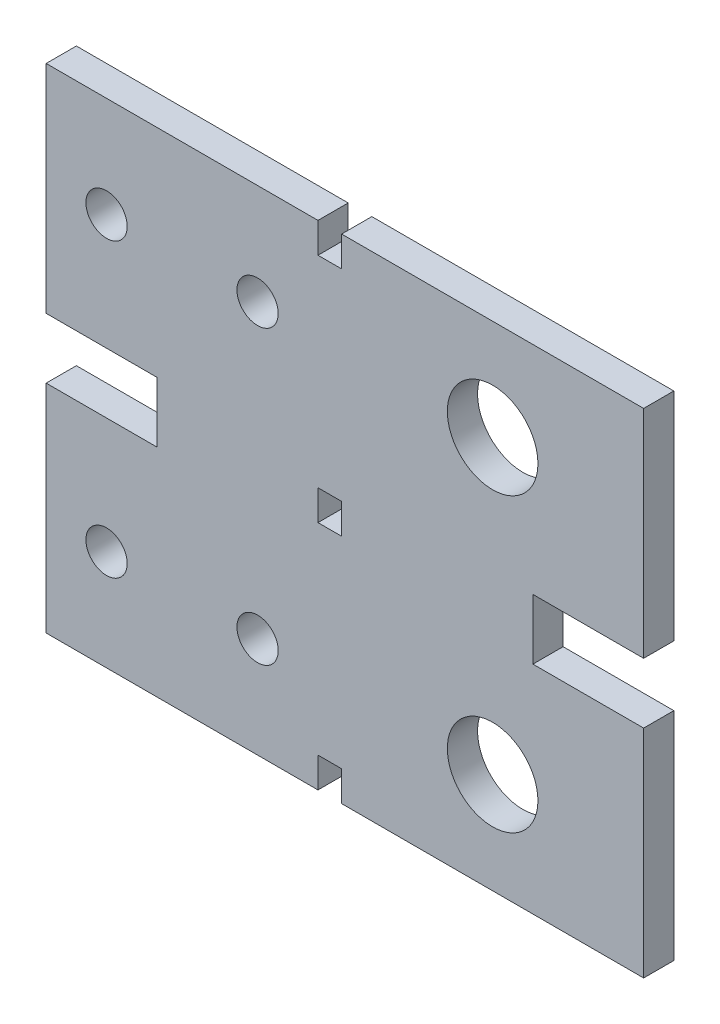
ISO-10303-21;
HEADER;
FILE_DESCRIPTION(('STEP AP214'),'2;1');
FILE_NAME('part.step','',(''),(''),'','','');
FILE_SCHEMA(('AUTOMOTIVE_DESIGN { 1 0 10303 214 1 1 1 1 }'));
ENDSEC;
DATA;
#1=APPLICATION_CONTEXT('core data for automotive mechanical design processes');
#2=APPLICATION_PROTOCOL_DEFINITION('international standard','automotive_design',2000,#1);
#3=PRODUCT_CONTEXT('',#1,'mechanical');
#4=PRODUCT('Part','Part','',(#3));
#5=PRODUCT_RELATED_PRODUCT_CATEGORY('part','',(#4));
#6=PRODUCT_DEFINITION_FORMATION('','',#4);
#7=PRODUCT_DEFINITION_CONTEXT('part definition',#1,'design');
#8=PRODUCT_DEFINITION('design','',#6,#7);
#9=PRODUCT_DEFINITION_SHAPE('','',#8);
#10=(LENGTH_UNIT() NAMED_UNIT(*) SI_UNIT(.MILLI.,.METRE.));
#11=(NAMED_UNIT(*) PLANE_ANGLE_UNIT() SI_UNIT($,.RADIAN.));
#12=(NAMED_UNIT(*) SI_UNIT($,.STERADIAN.) SOLID_ANGLE_UNIT());
#13=UNCERTAINTY_MEASURE_WITH_UNIT(LENGTH_MEASURE(1.E-05),#10,'distance_accuracy_value','');
#14=(GEOMETRIC_REPRESENTATION_CONTEXT(3) GLOBAL_UNCERTAINTY_ASSIGNED_CONTEXT((#13)) GLOBAL_UNIT_ASSIGNED_CONTEXT((#10,
#11,#12)) REPRESENTATION_CONTEXT('',''));
#15=CARTESIAN_POINT('',(0.,0.,0.));
#16=DIRECTION('',(0.,0.,1.));
#17=DIRECTION('',(1.,0.,0.));
#18=AXIS2_PLACEMENT_3D('',#15,#16,#17);
#19=CARTESIAN_POINT('',(0.,0.,3.));
#20=DIRECTION('',(1.,0.,0.));
#21=DIRECTION('',(0.,0.,-1.));
#22=AXIS2_PLACEMENT_3D('',#19,#20,#21);
#23=PLANE('',#22);
#24=DIRECTION('',(0.,-1.,0.));
#25=VECTOR('',#24,1.);
#26=CARTESIAN_POINT('',(0.,0.,0.));
#27=LINE('',#26,#25);
#28=CARTESIAN_POINT('',(0.,49.,0.));
#29=VERTEX_POINT('',#28);
#30=CARTESIAN_POINT('',(0.,27.5,0.));
#31=VERTEX_POINT('',#30);
#32=EDGE_CURVE('E382',#29,#31,#27,.T.);
#33=ORIENTED_EDGE('',*,*,#32,.T.);
#34=DIRECTION('',(0.,0.,1.));
#35=VECTOR('',#34,1.);
#36=CARTESIAN_POINT('',(0.,27.5,0.));
#37=LINE('',#36,#35);
#38=CARTESIAN_POINT('',(0.,27.5,3.));
#39=VERTEX_POINT('',#38);
#40=EDGE_CURVE('E259',#31,#39,#37,.T.);
#41=ORIENTED_EDGE('',*,*,#40,.T.);
#42=DIRECTION('',(0.,-1.,0.));
#43=VECTOR('',#42,1.);
#44=CARTESIAN_POINT('',(0.,0.,3.));
#45=LINE('',#44,#43);
#46=CARTESIAN_POINT('',(0.,49.,3.));
#47=VERTEX_POINT('',#46);
#48=EDGE_CURVE('E241',#47,#39,#45,.T.);
#49=ORIENTED_EDGE('',*,*,#48,.F.);
#50=DIRECTION('',(0.,0.,-1.));
#51=VECTOR('',#50,1.);
#52=CARTESIAN_POINT('',(0.,49.,3.));
#53=LINE('',#52,#51);
#54=EDGE_CURVE('E444',#47,#29,#53,.T.);
#55=ORIENTED_EDGE('',*,*,#54,.T.);
#56=EDGE_LOOP('',(#33,#41,#49,#55));
#57=FACE_BOUND('',#56,.T.);
#58=ADVANCED_FACE('F38',(#57),#23,.F.);
#59=CARTESIAN_POINT('',(59.35,0.,-58.7156069541992));
#60=DIRECTION('',(1.,0.,0.));
#61=DIRECTION('',(0.,0.,-1.));
#62=AXIS2_PLACEMENT_3D('',#59,#60,#61);
#63=PLANE('',#62);
#64=DIRECTION('',(0.,0.,1.));
#65=VECTOR('',#64,1.);
#66=CARTESIAN_POINT('',(59.35,21.5,0.));
#67=LINE('',#66,#65);
#68=CARTESIAN_POINT('',(59.35,21.5,0.));
#69=VERTEX_POINT('',#68);
#70=CARTESIAN_POINT('',(59.35,21.5,3.));
#71=VERTEX_POINT('',#70);
#72=EDGE_CURVE('E231',#69,#71,#67,.T.);
#73=ORIENTED_EDGE('',*,*,#72,.T.);
#74=DIRECTION('',(0.,1.,0.));
#75=VECTOR('',#74,1.);
#76=CARTESIAN_POINT('',(59.35,0.,3.));
#77=LINE('',#76,#75);
#78=CARTESIAN_POINT('',(59.35,0.,3.));
#79=VERTEX_POINT('',#78);
#80=EDGE_CURVE('E290',#79,#71,#77,.T.);
#81=ORIENTED_EDGE('',*,*,#80,.F.);
#82=DIRECTION('',(0.,0.,1.));
#83=VECTOR('',#82,1.);
#84=CARTESIAN_POINT('',(59.35,0.,-58.7156069541992));
#85=LINE('',#84,#83);
#86=CARTESIAN_POINT('',(59.35,0.,0.));
#87=VERTEX_POINT('',#86);
#88=EDGE_CURVE('E335',#87,#79,#85,.T.);
#89=ORIENTED_EDGE('',*,*,#88,.F.);
#90=DIRECTION('',(0.,1.,0.));
#91=VECTOR('',#90,1.);
#92=CARTESIAN_POINT('',(59.35,0.,0.));
#93=LINE('',#92,#91);
#94=EDGE_CURVE('E500',#87,#69,#93,.T.);
#95=ORIENTED_EDGE('',*,*,#94,.T.);
#96=EDGE_LOOP('',(#73,#81,#89,#95));
#97=FACE_BOUND('',#96,.T.);
#98=ADVANCED_FACE('F406',(#97),#63,.T.);
#99=CARTESIAN_POINT('',(27.,0.,3.));
#100=DIRECTION('',(-1.,0.,0.));
#101=DIRECTION('',(0.,0.,1.));
#102=AXIS2_PLACEMENT_3D('',#99,#100,#101);
#103=PLANE('',#102);
#104=DIRECTION('',(0.,1.,0.));
#105=VECTOR('',#104,1.);
#106=CARTESIAN_POINT('',(27.,0.,0.));
#107=LINE('',#106,#105);
#108=CARTESIAN_POINT('',(27.,0.,0.));
#109=VERTEX_POINT('',#108);
#110=CARTESIAN_POINT('',(27.,3.,0.));
#111=VERTEX_POINT('',#110);
#112=EDGE_CURVE('E433',#109,#111,#107,.T.);
#113=ORIENTED_EDGE('',*,*,#112,.T.);
#114=DIRECTION('',(0.,0.,1.));
#115=VECTOR('',#114,1.);
#116=CARTESIAN_POINT('',(27.,3.,-58.7156069541992));
#117=LINE('',#116,#115);
#118=CARTESIAN_POINT('',(27.,3.,3.));
#119=VERTEX_POINT('',#118);
#120=EDGE_CURVE('E466',#111,#119,#117,.T.);
#121=ORIENTED_EDGE('',*,*,#120,.T.);
#122=DIRECTION('',(0.,1.,0.));
#123=VECTOR('',#122,1.);
#124=CARTESIAN_POINT('',(27.,0.,3.));
#125=LINE('',#124,#123);
#126=CARTESIAN_POINT('',(27.,0.,3.));
#127=VERTEX_POINT('',#126);
#128=EDGE_CURVE('E455',#127,#119,#125,.T.);
#129=ORIENTED_EDGE('',*,*,#128,.F.);
#130=DIRECTION('',(0.,0.,-1.));
#131=VECTOR('',#130,1.);
#132=CARTESIAN_POINT('',(27.,0.,3.));
#133=LINE('',#132,#131);
#134=EDGE_CURVE('E46',#127,#109,#133,.T.);
#135=ORIENTED_EDGE('',*,*,#134,.T.);
#136=EDGE_LOOP('',(#113,#121,#129,#135));
#137=FACE_BOUND('',#136,.T.);
#138=ADVANCED_FACE('F411',(#137),#103,.F.);
#139=CARTESIAN_POINT('',(27.,23.,3.));
#140=VERTEX_POINT('',#139);
#141=CARTESIAN_POINT('',(27.,26.,3.));
#142=VERTEX_POINT('',#141);
#143=EDGE_CURVE('E547',#140,#142,#125,.T.);
#144=ORIENTED_EDGE('',*,*,#143,.F.);
#145=DIRECTION('',(0.,0.,1.));
#146=VECTOR('',#145,1.);
#147=CARTESIAN_POINT('',(27.,23.,-58.7156069541992));
#148=LINE('',#147,#146);
#149=CARTESIAN_POINT('',(27.,23.,0.));
#150=VERTEX_POINT('',#149);
#151=EDGE_CURVE('E471',#150,#140,#148,.T.);
#152=ORIENTED_EDGE('',*,*,#151,.F.);
#153=CARTESIAN_POINT('',(27.,26.,0.));
#154=VERTEX_POINT('',#153);
#155=EDGE_CURVE('E439',#150,#154,#107,.T.);
#156=ORIENTED_EDGE('',*,*,#155,.T.);
#157=DIRECTION('',(0.,0.,1.));
#158=VECTOR('',#157,1.);
#159=CARTESIAN_POINT('',(27.,26.,-58.7156069541992));
#160=LINE('',#159,#158);
#161=EDGE_CURVE('E484',#154,#142,#160,.T.);
#162=ORIENTED_EDGE('',*,*,#161,.T.);
#163=EDGE_LOOP('',(#144,#152,#156,#162));
#164=FACE_BOUND('',#163,.T.);
#165=ADVANCED_FACE('F573',(#164),#103,.F.);
#166=CARTESIAN_POINT('',(0.,0.,3.));
#167=DIRECTION('',(0.,0.,-1.));
#168=DIRECTION('',(-1.,0.,0.));
#169=AXIS2_PLACEMENT_3D('',#166,#167,#168);
#170=PLANE('',#169);
#171=ORIENTED_EDGE('',*,*,#143,.T.);
#172=DIRECTION('',(1.,0.,0.));
#173=VECTOR('',#172,1.);
#174=CARTESIAN_POINT('',(27.,26.,3.));
#175=LINE('',#174,#173);
#176=CARTESIAN_POINT('',(29.35,26.,3.));
#177=VERTEX_POINT('',#176);
#178=EDGE_CURVE('E539',#142,#177,#175,.T.);
#179=ORIENTED_EDGE('',*,*,#178,.T.);
#180=DIRECTION('',(0.,-1.,0.));
#181=VECTOR('',#180,1.);
#182=CARTESIAN_POINT('',(29.35,23.,3.));
#183=LINE('',#182,#181);
#184=CARTESIAN_POINT('',(29.35,23.,3.));
#185=VERTEX_POINT('',#184);
#186=EDGE_CURVE('E557',#177,#185,#183,.T.);
#187=ORIENTED_EDGE('',*,*,#186,.T.);
#188=DIRECTION('',(-1.,0.,0.));
#189=VECTOR('',#188,1.);
#190=CARTESIAN_POINT('',(27.,23.,3.));
#191=LINE('',#190,#189);
#192=EDGE_CURVE('E321',#185,#140,#191,.T.);
#193=ORIENTED_EDGE('',*,*,#192,.T.);
#194=EDGE_LOOP('',(#171,#179,#187,#193));
#195=FACE_BOUND('',#194,.T.);
#196=ORIENTED_EDGE('',*,*,#48,.T.);
#197=DIRECTION('',(-1.,0.,0.));
#198=VECTOR('',#197,1.);
#199=CARTESIAN_POINT('',(0.,27.5,3.));
#200=LINE('',#199,#198);
#201=CARTESIAN_POINT('',(11.,27.5,3.));
#202=VERTEX_POINT('',#201);
#203=EDGE_CURVE('E221',#202,#39,#200,.T.);
#204=ORIENTED_EDGE('',*,*,#203,.F.);
#205=DIRECTION('',(0.,1.,0.));
#206=VECTOR('',#205,1.);
#207=CARTESIAN_POINT('',(11.,27.5,3.));
#208=LINE('',#207,#206);
#209=CARTESIAN_POINT('',(11.,21.5,3.));
#210=VERTEX_POINT('',#209);
#211=EDGE_CURVE('E224',#210,#202,#208,.T.);
#212=ORIENTED_EDGE('',*,*,#211,.F.);
#213=DIRECTION('',(1.,0.,0.));
#214=VECTOR('',#213,1.);
#215=CARTESIAN_POINT('',(0.,21.5,3.));
#216=LINE('',#215,#214);
#217=CARTESIAN_POINT('',(0.,21.5,3.));
#218=VERTEX_POINT('',#217);
#219=EDGE_CURVE('E201',#218,#210,#216,.T.);
#220=ORIENTED_EDGE('',*,*,#219,.F.);
#221=CARTESIAN_POINT('',(0.,0.,3.));
#222=VERTEX_POINT('',#221);
#223=EDGE_CURVE('E247',#218,#222,#45,.T.);
#224=ORIENTED_EDGE('',*,*,#223,.T.);
#225=DIRECTION('',(1.,0.,0.));
#226=VECTOR('',#225,1.);
#227=CARTESIAN_POINT('',(0.,0.,3.));
#228=LINE('',#227,#226);
#229=EDGE_CURVE('E246',#222,#127,#228,.T.);
#230=ORIENTED_EDGE('',*,*,#229,.T.);
#231=ORIENTED_EDGE('',*,*,#128,.T.);
#232=DIRECTION('',(1.,0.,0.));
#233=VECTOR('',#232,1.);
#234=CARTESIAN_POINT('',(27.,3.,3.));
#235=LINE('',#234,#233);
#236=CARTESIAN_POINT('',(29.35,3.,3.));
#237=VERTEX_POINT('',#236);
#238=EDGE_CURVE('E316',#119,#237,#235,.T.);
#239=ORIENTED_EDGE('',*,*,#238,.T.);
#240=DIRECTION('',(0.,-1.,0.));
#241=VECTOR('',#240,1.);
#242=CARTESIAN_POINT('',(29.35,0.,3.));
#243=LINE('',#242,#241);
#244=CARTESIAN_POINT('',(29.35,0.,3.));
#245=VERTEX_POINT('',#244);
#246=EDGE_CURVE('E325',#237,#245,#243,.T.);
#247=ORIENTED_EDGE('',*,*,#246,.T.);
#248=DIRECTION('',(1.,0.,0.));
#249=VECTOR('',#248,1.);
#250=CARTESIAN_POINT('',(29.35,0.,3.));
#251=LINE('',#250,#249);
#252=EDGE_CURVE('E299',#245,#79,#251,.T.);
#253=ORIENTED_EDGE('',*,*,#252,.T.);
#254=ORIENTED_EDGE('',*,*,#80,.T.);
#255=DIRECTION('',(1.,0.,0.));
#256=VECTOR('',#255,1.);
#257=CARTESIAN_POINT('',(59.35,21.5,3.));
#258=LINE('',#257,#256);
#259=CARTESIAN_POINT('',(48.35,21.5,3.));
#260=VERTEX_POINT('',#259);
#261=EDGE_CURVE('E267',#260,#71,#258,.T.);
#262=ORIENTED_EDGE('',*,*,#261,.F.);
#263=DIRECTION('',(0.,-1.,0.));
#264=VECTOR('',#263,1.);
#265=CARTESIAN_POINT('',(48.35,27.5,3.));
#266=LINE('',#265,#264);
#267=CARTESIAN_POINT('',(48.35,27.5,3.));
#268=VERTEX_POINT('',#267);
#269=EDGE_CURVE('E279',#268,#260,#266,.T.);
#270=ORIENTED_EDGE('',*,*,#269,.F.);
#271=DIRECTION('',(-1.,0.,0.));
#272=VECTOR('',#271,1.);
#273=CARTESIAN_POINT('',(59.35,27.5,3.));
#274=LINE('',#273,#272);
#275=CARTESIAN_POINT('',(59.35,27.5,3.));
#276=VERTEX_POINT('',#275);
#277=EDGE_CURVE('E274',#276,#268,#274,.T.);
#278=ORIENTED_EDGE('',*,*,#277,.F.);
#279=CARTESIAN_POINT('',(59.35,49.,3.));
#280=VERTEX_POINT('',#279);
#281=EDGE_CURVE('E296',#276,#280,#77,.T.);
#282=ORIENTED_EDGE('',*,*,#281,.T.);
#283=DIRECTION('',(-1.,0.,0.));
#284=VECTOR('',#283,1.);
#285=CARTESIAN_POINT('',(29.35,49.,3.));
#286=LINE('',#285,#284);
#287=CARTESIAN_POINT('',(29.35,49.,3.));
#288=VERTEX_POINT('',#287);
#289=EDGE_CURVE('E295',#280,#288,#286,.T.);
#290=ORIENTED_EDGE('',*,*,#289,.T.);
#291=DIRECTION('',(0.,-1.,0.));
#292=VECTOR('',#291,1.);
#293=CARTESIAN_POINT('',(29.35,46.,3.));
#294=LINE('',#293,#292);
#295=CARTESIAN_POINT('',(29.35,46.,3.));
#296=VERTEX_POINT('',#295);
#297=EDGE_CURVE('E533',#288,#296,#294,.T.);
#298=ORIENTED_EDGE('',*,*,#297,.T.);
#299=DIRECTION('',(-1.,0.,0.));
#300=VECTOR('',#299,1.);
#301=CARTESIAN_POINT('',(27.,46.,3.));
#302=LINE('',#301,#300);
#303=CARTESIAN_POINT('',(27.,46.,3.));
#304=VERTEX_POINT('',#303);
#305=EDGE_CURVE('E536',#296,#304,#302,.T.);
#306=ORIENTED_EDGE('',*,*,#305,.T.);
#307=CARTESIAN_POINT('',(27.,49.,3.));
#308=VERTEX_POINT('',#307);
#309=EDGE_CURVE('E548',#304,#308,#125,.T.);
#310=ORIENTED_EDGE('',*,*,#309,.T.);
#311=DIRECTION('',(-1.,0.,0.));
#312=VECTOR('',#311,1.);
#313=CARTESIAN_POINT('',(0.,49.,3.));
#314=LINE('',#313,#312);
#315=EDGE_CURVE('E447',#308,#47,#314,.T.);
#316=ORIENTED_EDGE('',*,*,#315,.T.);
#317=EDGE_LOOP('',(#196,#204,#212,#220,#224,#230,#231,#239,#247,#253,#254,#262,#270,#278,#282,
#290,#298,#306,#310,#316));
#318=FACE_BOUND('',#317,.T.);
#319=CARTESIAN_POINT('',(6.00000000000001,39.,3.));
#320=DIRECTION('',(0.,0.,1.));
#321=DIRECTION('',(1.,0.,0.));
#322=AXIS2_PLACEMENT_3D('',#319,#320,#321);
#323=CIRCLE('',#322,2.05000000000001);
#324=CARTESIAN_POINT('',(8.05000000000001,39.,3.));
#325=VERTEX_POINT('',#324);
#326=EDGE_CURVE('E375',#325,#325,#323,.T.);
#327=ORIENTED_EDGE('',*,*,#326,.F.);
#328=EDGE_LOOP('',(#327));
#329=FACE_BOUND('',#328,.T.);
#330=CARTESIAN_POINT('',(21.,39.,3.));
#331=DIRECTION('',(0.,0.,1.));
#332=DIRECTION('',(1.,0.,0.));
#333=AXIS2_PLACEMENT_3D('',#330,#331,#332);
#334=CIRCLE('',#333,2.05);
#335=CARTESIAN_POINT('',(23.05,39.,3.));
#336=VERTEX_POINT('',#335);
#337=EDGE_CURVE('E366',#336,#336,#334,.T.);
#338=ORIENTED_EDGE('',*,*,#337,.F.);
#339=EDGE_LOOP('',(#338));
#340=FACE_BOUND('',#339,.T.);
#341=CARTESIAN_POINT('',(6.,10.,3.));
#342=DIRECTION('',(0.,0.,1.));
#343=DIRECTION('',(1.,0.,0.));
#344=AXIS2_PLACEMENT_3D('',#341,#342,#343);
#345=CIRCLE('',#344,2.05);
#346=CARTESIAN_POINT('',(8.05,10.,3.));
#347=VERTEX_POINT('',#346);
#348=EDGE_CURVE('E358',#347,#347,#345,.T.);
#349=ORIENTED_EDGE('',*,*,#348,.F.);
#350=EDGE_LOOP('',(#349));
#351=FACE_BOUND('',#350,.T.);
#352=CARTESIAN_POINT('',(21.,10.,3.));
#353=DIRECTION('',(0.,0.,1.));
#354=DIRECTION('',(1.,0.,0.));
#355=AXIS2_PLACEMENT_3D('',#352,#353,#354);
#356=CIRCLE('',#355,2.05);
#357=CARTESIAN_POINT('',(23.05,10.,3.));
#358=VERTEX_POINT('',#357);
#359=EDGE_CURVE('E347',#358,#358,#356,.T.);
#360=ORIENTED_EDGE('',*,*,#359,.F.);
#361=EDGE_LOOP('',(#360));
#362=FACE_BOUND('',#361,.T.);
#363=CARTESIAN_POINT('',(44.35,10.,3.));
#364=DIRECTION('',(0.,0.,1.));
#365=DIRECTION('',(1.,0.,0.));
#366=AXIS2_PLACEMENT_3D('',#363,#364,#365);
#367=CIRCLE('',#366,4.5);
#368=CARTESIAN_POINT('',(48.85,10.,3.));
#369=VERTEX_POINT('',#368);
#370=EDGE_CURVE('E329',#369,#369,#367,.T.);
#371=ORIENTED_EDGE('',*,*,#370,.F.);
#372=EDGE_LOOP('',(#371));
#373=FACE_BOUND('',#372,.T.);
#374=CARTESIAN_POINT('',(44.35,39.,3.));
#375=DIRECTION('',(0.,0.,1.));
#376=DIRECTION('',(1.,0.,0.));
#377=AXIS2_PLACEMENT_3D('',#374,#375,#376);
#378=CIRCLE('',#377,4.5);
#379=CARTESIAN_POINT('',(48.85,39.,3.));
#380=VERTEX_POINT('',#379);
#381=EDGE_CURVE('E330',#380,#380,#378,.T.);
#382=ORIENTED_EDGE('',*,*,#381,.F.);
#383=EDGE_LOOP('',(#382));
#384=FACE_BOUND('',#383,.T.);
#385=ADVANCED_FACE('F424',(#195,#318,#329,#340,#351,#362,#373,#384),#170,.F.);
#386=CARTESIAN_POINT('',(0.,0.,0.));
#387=DIRECTION('',(0.,0.,-1.));
#388=DIRECTION('',(-1.,0.,0.));
#389=AXIS2_PLACEMENT_3D('',#386,#387,#388);
#390=PLANE('',#389);
#391=DIRECTION('',(-1.,0.,0.));
#392=VECTOR('',#391,1.);
#393=CARTESIAN_POINT('',(0.,27.5,0.));
#394=LINE('',#393,#392);
#395=CARTESIAN_POINT('',(11.,27.5,0.));
#396=VERTEX_POINT('',#395);
#397=EDGE_CURVE('E214',#396,#31,#394,.T.);
#398=ORIENTED_EDGE('',*,*,#397,.T.);
#399=ORIENTED_EDGE('',*,*,#32,.F.);
#400=DIRECTION('',(-1.,0.,0.));
#401=VECTOR('',#400,1.);
#402=CARTESIAN_POINT('',(0.,49.,0.));
#403=LINE('',#402,#401);
#404=CARTESIAN_POINT('',(27.,49.,0.));
#405=VERTEX_POINT('',#404);
#406=EDGE_CURVE('E431',#405,#29,#403,.T.);
#407=ORIENTED_EDGE('',*,*,#406,.F.);
#408=CARTESIAN_POINT('',(27.,46.,0.));
#409=VERTEX_POINT('',#408);
#410=EDGE_CURVE('E441',#409,#405,#107,.T.);
#411=ORIENTED_EDGE('',*,*,#410,.F.);
#412=DIRECTION('',(-1.,0.,0.));
#413=VECTOR('',#412,1.);
#414=CARTESIAN_POINT('',(27.,46.,0.));
#415=LINE('',#414,#413);
#416=CARTESIAN_POINT('',(29.35,46.,0.));
#417=VERTEX_POINT('',#416);
#418=EDGE_CURVE('E486',#417,#409,#415,.T.);
#419=ORIENTED_EDGE('',*,*,#418,.F.);
#420=DIRECTION('',(0.,-1.,0.));
#421=VECTOR('',#420,1.);
#422=CARTESIAN_POINT('',(29.35,46.,0.));
#423=LINE('',#422,#421);
#424=CARTESIAN_POINT('',(29.35,49.,0.));
#425=VERTEX_POINT('',#424);
#426=EDGE_CURVE('E490',#425,#417,#423,.T.);
#427=ORIENTED_EDGE('',*,*,#426,.F.);
#428=DIRECTION('',(-1.,0.,0.));
#429=VECTOR('',#428,1.);
#430=CARTESIAN_POINT('',(29.35,49.,0.));
#431=LINE('',#430,#429);
#432=CARTESIAN_POINT('',(59.35,49.,0.));
#433=VERTEX_POINT('',#432);
#434=EDGE_CURVE('E493',#433,#425,#431,.T.);
#435=ORIENTED_EDGE('',*,*,#434,.F.);
#436=CARTESIAN_POINT('',(59.35,27.5,0.));
#437=VERTEX_POINT('',#436);
#438=EDGE_CURVE('E496',#437,#433,#93,.T.);
#439=ORIENTED_EDGE('',*,*,#438,.F.);
#440=DIRECTION('',(-1.,0.,0.));
#441=VECTOR('',#440,1.);
#442=CARTESIAN_POINT('',(59.35,27.5,0.));
#443=LINE('',#442,#441);
#444=CARTESIAN_POINT('',(48.35,27.5,0.));
#445=VERTEX_POINT('',#444);
#446=EDGE_CURVE('E61',#437,#445,#443,.T.);
#447=ORIENTED_EDGE('',*,*,#446,.T.);
#448=DIRECTION('',(0.,-1.,0.));
#449=VECTOR('',#448,1.);
#450=CARTESIAN_POINT('',(48.35,27.5,0.));
#451=LINE('',#450,#449);
#452=CARTESIAN_POINT('',(48.35,21.5,0.));
#453=VERTEX_POINT('',#452);
#454=EDGE_CURVE('E266',#445,#453,#451,.T.);
#455=ORIENTED_EDGE('',*,*,#454,.T.);
#456=DIRECTION('',(1.,0.,0.));
#457=VECTOR('',#456,1.);
#458=CARTESIAN_POINT('',(59.35,21.5,0.));
#459=LINE('',#458,#457);
#460=EDGE_CURVE('E270',#453,#69,#459,.T.);
#461=ORIENTED_EDGE('',*,*,#460,.T.);
#462=ORIENTED_EDGE('',*,*,#94,.F.);
#463=DIRECTION('',(1.,0.,0.));
#464=VECTOR('',#463,1.);
#465=CARTESIAN_POINT('',(29.35,0.,0.));
#466=LINE('',#465,#464);
#467=CARTESIAN_POINT('',(29.35,0.,0.));
#468=VERTEX_POINT('',#467);
#469=EDGE_CURVE('E499',#468,#87,#466,.T.);
#470=ORIENTED_EDGE('',*,*,#469,.F.);
#471=DIRECTION('',(0.,-1.,0.));
#472=VECTOR('',#471,1.);
#473=CARTESIAN_POINT('',(29.35,0.,0.));
#474=LINE('',#473,#472);
#475=CARTESIAN_POINT('',(29.35,3.,0.));
#476=VERTEX_POINT('',#475);
#477=EDGE_CURVE('E262',#476,#468,#474,.T.);
#478=ORIENTED_EDGE('',*,*,#477,.F.);
#479=DIRECTION('',(1.,0.,0.));
#480=VECTOR('',#479,1.);
#481=CARTESIAN_POINT('',(27.,3.,0.));
#482=LINE('',#481,#480);
#483=EDGE_CURVE('E458',#111,#476,#482,.T.);
#484=ORIENTED_EDGE('',*,*,#483,.F.);
#485=ORIENTED_EDGE('',*,*,#112,.F.);
#486=DIRECTION('',(1.,0.,0.));
#487=VECTOR('',#486,1.);
#488=CARTESIAN_POINT('',(0.,0.,0.));
#489=LINE('',#488,#487);
#490=CARTESIAN_POINT('',(0.,0.,0.));
#491=VERTEX_POINT('',#490);
#492=EDGE_CURVE('E456',#491,#109,#489,.T.);
#493=ORIENTED_EDGE('',*,*,#492,.F.);
#494=CARTESIAN_POINT('',(0.,21.5,0.));
#495=VERTEX_POINT('',#494);
#496=EDGE_CURVE('E220',#495,#491,#27,.T.);
#497=ORIENTED_EDGE('',*,*,#496,.F.);
#498=DIRECTION('',(1.,0.,0.));
#499=VECTOR('',#498,1.);
#500=CARTESIAN_POINT('',(0.,21.5,0.));
#501=LINE('',#500,#499);
#502=CARTESIAN_POINT('',(11.,21.5,0.));
#503=VERTEX_POINT('',#502);
#504=EDGE_CURVE('E53',#495,#503,#501,.T.);
#505=ORIENTED_EDGE('',*,*,#504,.T.);
#506=DIRECTION('',(0.,1.,0.));
#507=VECTOR('',#506,1.);
#508=CARTESIAN_POINT('',(11.,27.5,0.));
#509=LINE('',#508,#507);
#510=EDGE_CURVE('E209',#503,#396,#509,.T.);
#511=ORIENTED_EDGE('',*,*,#510,.T.);
#512=EDGE_LOOP('',(#398,#399,#407,#411,#419,#427,#435,#439,#447,#455,#461,#462,#470,#478,#484,
#485,#493,#497,#505,#511));
#513=FACE_BOUND('',#512,.T.);
#514=DIRECTION('',(1.,0.,0.));
#515=VECTOR('',#514,1.);
#516=CARTESIAN_POINT('',(27.,26.,0.));
#517=LINE('',#516,#515);
#518=CARTESIAN_POINT('',(29.35,26.,0.));
#519=VERTEX_POINT('',#518);
#520=EDGE_CURVE('E481',#154,#519,#517,.T.);
#521=ORIENTED_EDGE('',*,*,#520,.F.);
#522=ORIENTED_EDGE('',*,*,#155,.F.);
#523=DIRECTION('',(-1.,0.,0.));
#524=VECTOR('',#523,1.);
#525=CARTESIAN_POINT('',(27.,23.,0.));
#526=LINE('',#525,#524);
#527=CARTESIAN_POINT('',(29.35,23.,0.));
#528=VERTEX_POINT('',#527);
#529=EDGE_CURVE('E468',#528,#150,#526,.T.);
#530=ORIENTED_EDGE('',*,*,#529,.F.);
#531=DIRECTION('',(0.,-1.,0.));
#532=VECTOR('',#531,1.);
#533=CARTESIAN_POINT('',(29.35,23.,0.));
#534=LINE('',#533,#532);
#535=EDGE_CURVE('E478',#519,#528,#534,.T.);
#536=ORIENTED_EDGE('',*,*,#535,.F.);
#537=EDGE_LOOP('',(#521,#522,#530,#536));
#538=FACE_BOUND('',#537,.T.);
#539=CARTESIAN_POINT('',(6.,10.,0.));
#540=DIRECTION('',(0.,0.,1.));
#541=DIRECTION('',(1.,0.,0.));
#542=AXIS2_PLACEMENT_3D('',#539,#540,#541);
#543=CIRCLE('',#542,2.05);
#544=CARTESIAN_POINT('',(8.05,10.,0.));
#545=VERTEX_POINT('',#544);
#546=EDGE_CURVE('E353',#545,#545,#543,.T.);
#547=ORIENTED_EDGE('',*,*,#546,.T.);
#548=EDGE_LOOP('',(#547));
#549=FACE_BOUND('',#548,.T.);
#550=CARTESIAN_POINT('',(6.00000000000001,39.,0.));
#551=DIRECTION('',(0.,0.,1.));
#552=DIRECTION('',(1.,0.,0.));
#553=AXIS2_PLACEMENT_3D('',#550,#551,#552);
#554=CIRCLE('',#553,2.05000000000001);
#555=CARTESIAN_POINT('',(8.05000000000001,39.,0.));
#556=VERTEX_POINT('',#555);
#557=EDGE_CURVE('E248',#556,#556,#554,.T.);
#558=ORIENTED_EDGE('',*,*,#557,.T.);
#559=EDGE_LOOP('',(#558));
#560=FACE_BOUND('',#559,.T.);
#561=CARTESIAN_POINT('',(21.,39.,0.));
#562=DIRECTION('',(0.,0.,1.));
#563=DIRECTION('',(1.,0.,0.));
#564=AXIS2_PLACEMENT_3D('',#561,#562,#563);
#565=CIRCLE('',#564,2.05);
#566=CARTESIAN_POINT('',(23.05,39.,0.));
#567=VERTEX_POINT('',#566);
#568=EDGE_CURVE('E363',#567,#567,#565,.T.);
#569=ORIENTED_EDGE('',*,*,#568,.T.);
#570=EDGE_LOOP('',(#569));
#571=FACE_BOUND('',#570,.T.);
#572=CARTESIAN_POINT('',(21.,10.,0.));
#573=DIRECTION('',(0.,0.,1.));
#574=DIRECTION('',(1.,0.,0.));
#575=AXIS2_PLACEMENT_3D('',#572,#573,#574);
#576=CIRCLE('',#575,2.05);
#577=CARTESIAN_POINT('',(23.05,10.,0.));
#578=VERTEX_POINT('',#577);
#579=EDGE_CURVE('E354',#578,#578,#576,.T.);
#580=ORIENTED_EDGE('',*,*,#579,.T.);
#581=EDGE_LOOP('',(#580));
#582=FACE_BOUND('',#581,.T.);
#583=CARTESIAN_POINT('',(44.35,10.,0.));
#584=DIRECTION('',(0.,0.,-1.));
#585=DIRECTION('',(-1.,0.,0.));
#586=AXIS2_PLACEMENT_3D('',#583,#584,#585);
#587=CIRCLE('',#586,4.5);
#588=CARTESIAN_POINT('',(39.85,10.,0.));
#589=VERTEX_POINT('',#588);
#590=EDGE_CURVE('E320',#589,#589,#587,.F.);
#591=ORIENTED_EDGE('',*,*,#590,.T.);
#592=EDGE_LOOP('',(#591));
#593=FACE_BOUND('',#592,.T.);
#594=CARTESIAN_POINT('',(44.35,39.,0.));
#595=DIRECTION('',(0.,0.,-1.));
#596=DIRECTION('',(-1.,0.,0.));
#597=AXIS2_PLACEMENT_3D('',#594,#595,#596);
#598=CIRCLE('',#597,4.5);
#599=CARTESIAN_POINT('',(39.85,39.,0.));
#600=VERTEX_POINT('',#599);
#601=EDGE_CURVE('E340',#600,#600,#598,.F.);
#602=ORIENTED_EDGE('',*,*,#601,.T.);
#603=EDGE_LOOP('',(#602));
#604=FACE_BOUND('',#603,.T.);
#605=ADVANCED_FACE('F217',(#513,#538,#549,#560,#571,#582,#593,#604),#390,.T.);
#606=ORIENTED_EDGE('',*,*,#223,.F.);
#607=DIRECTION('',(0.,0.,1.));
#608=VECTOR('',#607,1.);
#609=CARTESIAN_POINT('',(0.,21.5,0.));
#610=LINE('',#609,#608);
#611=EDGE_CURVE('E206',#495,#218,#610,.T.);
#612=ORIENTED_EDGE('',*,*,#611,.F.);
#613=ORIENTED_EDGE('',*,*,#496,.T.);
#614=DIRECTION('',(0.,0.,-1.));
#615=VECTOR('',#614,1.);
#616=CARTESIAN_POINT('',(0.,0.,3.));
#617=LINE('',#616,#615);
#618=EDGE_CURVE('E12',#222,#491,#617,.T.);
#619=ORIENTED_EDGE('',*,*,#618,.F.);
#620=EDGE_LOOP('',(#606,#612,#613,#619));
#621=FACE_BOUND('',#620,.T.);
#622=ADVANCED_FACE('F40',(#621),#23,.F.);
#623=CARTESIAN_POINT('',(0.,0.,3.));
#624=DIRECTION('',(0.,1.,0.));
#625=DIRECTION('',(0.,0.,1.));
#626=AXIS2_PLACEMENT_3D('',#623,#624,#625);
#627=PLANE('',#626);
#628=ORIENTED_EDGE('',*,*,#492,.T.);
#629=ORIENTED_EDGE('',*,*,#134,.F.);
#630=ORIENTED_EDGE('',*,*,#229,.F.);
#631=ORIENTED_EDGE('',*,*,#618,.T.);
#632=EDGE_LOOP('',(#628,#629,#630,#631));
#633=FACE_BOUND('',#632,.T.);
#634=ADVANCED_FACE('F417',(#633),#627,.F.);
#635=ORIENTED_EDGE('',*,*,#309,.F.);
#636=DIRECTION('',(0.,0.,1.));
#637=VECTOR('',#636,1.);
#638=CARTESIAN_POINT('',(27.,46.,-58.7156069541992));
#639=LINE('',#638,#637);
#640=EDGE_CURVE('E487',#409,#304,#639,.T.);
#641=ORIENTED_EDGE('',*,*,#640,.F.);
#642=ORIENTED_EDGE('',*,*,#410,.T.);
#643=DIRECTION('',(0.,0.,-1.));
#644=VECTOR('',#643,1.);
#645=CARTESIAN_POINT('',(27.,49.,3.));
#646=LINE('',#645,#644);
#647=EDGE_CURVE('E446',#308,#405,#646,.T.);
#648=ORIENTED_EDGE('',*,*,#647,.F.);
#649=EDGE_LOOP('',(#635,#641,#642,#648));
#650=FACE_BOUND('',#649,.T.);
#651=ADVANCED_FACE('F401',(#650),#103,.F.);
#652=CARTESIAN_POINT('',(0.,49.,3.));
#653=DIRECTION('',(0.,-1.,0.));
#654=DIRECTION('',(0.,0.,-1.));
#655=AXIS2_PLACEMENT_3D('',#652,#653,#654);
#656=PLANE('',#655);
#657=ORIENTED_EDGE('',*,*,#406,.T.);
#658=ORIENTED_EDGE('',*,*,#54,.F.);
#659=ORIENTED_EDGE('',*,*,#315,.F.);
#660=ORIENTED_EDGE('',*,*,#647,.T.);
#661=EDGE_LOOP('',(#657,#658,#659,#660));
#662=FACE_BOUND('',#661,.T.);
#663=ADVANCED_FACE('F392',(#662),#656,.F.);
#664=CARTESIAN_POINT('',(6.00000000000001,39.,3.));
#665=DIRECTION('',(0.,0.,-1.));
#666=DIRECTION('',(-1.,0.,0.));
#667=AXIS2_PLACEMENT_3D('',#664,#665,#666);
#668=CYLINDRICAL_SURFACE('',#667,2.05000000000001);
#669=ORIENTED_EDGE('',*,*,#326,.T.);
#670=EDGE_LOOP('',(#669));
#671=FACE_BOUND('',#670,.T.);
#672=ORIENTED_EDGE('',*,*,#557,.F.);
#673=EDGE_LOOP('',(#672));
#674=FACE_BOUND('',#673,.T.);
#675=ADVANCED_FACE('F389',(#671,#674),#668,.F.);
#676=CARTESIAN_POINT('',(21.,39.,3.));
#677=DIRECTION('',(0.,0.,-1.));
#678=DIRECTION('',(-1.,0.,0.));
#679=AXIS2_PLACEMENT_3D('',#676,#677,#678);
#680=CYLINDRICAL_SURFACE('',#679,2.05);
#681=ORIENTED_EDGE('',*,*,#337,.T.);
#682=EDGE_LOOP('',(#681));
#683=FACE_BOUND('',#682,.T.);
#684=ORIENTED_EDGE('',*,*,#568,.F.);
#685=EDGE_LOOP('',(#684));
#686=FACE_BOUND('',#685,.T.);
#687=ADVANCED_FACE('F391',(#683,#686),#680,.F.);
#688=CARTESIAN_POINT('',(6.,10.,3.));
#689=DIRECTION('',(0.,0.,-1.));
#690=DIRECTION('',(-1.,0.,0.));
#691=AXIS2_PLACEMENT_3D('',#688,#689,#690);
#692=CYLINDRICAL_SURFACE('',#691,2.05);
#693=ORIENTED_EDGE('',*,*,#348,.T.);
#694=EDGE_LOOP('',(#693));
#695=FACE_BOUND('',#694,.T.);
#696=ORIENTED_EDGE('',*,*,#546,.F.);
#697=EDGE_LOOP('',(#696));
#698=FACE_BOUND('',#697,.T.);
#699=ADVANCED_FACE('F398',(#695,#698),#692,.F.);
#700=CARTESIAN_POINT('',(21.,10.,3.));
#701=DIRECTION('',(0.,0.,-1.));
#702=DIRECTION('',(-1.,0.,0.));
#703=AXIS2_PLACEMENT_3D('',#700,#701,#702);
#704=CYLINDRICAL_SURFACE('',#703,2.05);
#705=ORIENTED_EDGE('',*,*,#359,.T.);
#706=EDGE_LOOP('',(#705));
#707=FACE_BOUND('',#706,.T.);
#708=ORIENTED_EDGE('',*,*,#579,.F.);
#709=EDGE_LOOP('',(#708));
#710=FACE_BOUND('',#709,.T.);
#711=ADVANCED_FACE('F618',(#707,#710),#704,.F.);
#712=CARTESIAN_POINT('',(29.35,0.,-58.7156069541992));
#713=DIRECTION('',(-1.,0.,0.));
#714=DIRECTION('',(0.,0.,1.));
#715=AXIS2_PLACEMENT_3D('',#712,#713,#714);
#716=PLANE('',#715);
#717=DIRECTION('',(0.,0.,1.));
#718=VECTOR('',#717,1.);
#719=CARTESIAN_POINT('',(29.35,3.,-58.7156069541992));
#720=LINE('',#719,#718);
#721=EDGE_CURVE('E463',#476,#237,#720,.T.);
#722=ORIENTED_EDGE('',*,*,#721,.F.);
#723=ORIENTED_EDGE('',*,*,#477,.T.);
#724=DIRECTION('',(0.,0.,1.));
#725=VECTOR('',#724,1.);
#726=CARTESIAN_POINT('',(29.35,0.,-58.7156069541992));
#727=LINE('',#726,#725);
#728=EDGE_CURVE('E355',#468,#245,#727,.T.);
#729=ORIENTED_EDGE('',*,*,#728,.T.);
#730=ORIENTED_EDGE('',*,*,#246,.F.);
#731=EDGE_LOOP('',(#722,#723,#729,#730));
#732=FACE_BOUND('',#731,.T.);
#733=ADVANCED_FACE('F615',(#732),#716,.T.);
#734=CARTESIAN_POINT('',(27.,3.,-58.7156069541992));
#735=DIRECTION('',(0.,-1.,0.));
#736=DIRECTION('',(1.,0.,0.));
#737=AXIS2_PLACEMENT_3D('',#734,#735,#736);
#738=PLANE('',#737);
#739=ORIENTED_EDGE('',*,*,#120,.F.);
#740=ORIENTED_EDGE('',*,*,#483,.T.);
#741=ORIENTED_EDGE('',*,*,#721,.T.);
#742=ORIENTED_EDGE('',*,*,#238,.F.);
#743=EDGE_LOOP('',(#739,#740,#741,#742));
#744=FACE_BOUND('',#743,.T.);
#745=ADVANCED_FACE('F467',(#744),#738,.T.);
#746=CARTESIAN_POINT('',(27.,23.,-58.7156069541992));
#747=DIRECTION('',(0.,1.,0.));
#748=DIRECTION('',(0.,0.,1.));
#749=AXIS2_PLACEMENT_3D('',#746,#747,#748);
#750=PLANE('',#749);
#751=DIRECTION('',(0.,0.,1.));
#752=VECTOR('',#751,1.);
#753=CARTESIAN_POINT('',(29.35,23.,-58.7156069541992));
#754=LINE('',#753,#752);
#755=EDGE_CURVE('E479',#528,#185,#754,.T.);
#756=ORIENTED_EDGE('',*,*,#755,.F.);
#757=ORIENTED_EDGE('',*,*,#529,.T.);
#758=ORIENTED_EDGE('',*,*,#151,.T.);
#759=ORIENTED_EDGE('',*,*,#192,.F.);
#760=EDGE_LOOP('',(#756,#757,#758,#759));
#761=FACE_BOUND('',#760,.T.);
#762=ADVANCED_FACE('F570',(#761),#750,.T.);
#763=CARTESIAN_POINT('',(29.35,23.,-58.7156069541992));
#764=DIRECTION('',(-1.,0.,0.));
#765=DIRECTION('',(0.,0.,1.));
#766=AXIS2_PLACEMENT_3D('',#763,#764,#765);
#767=PLANE('',#766);
#768=DIRECTION('',(0.,0.,1.));
#769=VECTOR('',#768,1.);
#770=CARTESIAN_POINT('',(29.35,26.,-58.7156069541992));
#771=LINE('',#770,#769);
#772=EDGE_CURVE('E482',#519,#177,#771,.T.);
#773=ORIENTED_EDGE('',*,*,#772,.F.);
#774=ORIENTED_EDGE('',*,*,#535,.T.);
#775=ORIENTED_EDGE('',*,*,#755,.T.);
#776=ORIENTED_EDGE('',*,*,#186,.F.);
#777=EDGE_LOOP('',(#773,#774,#775,#776));
#778=FACE_BOUND('',#777,.T.);
#779=ADVANCED_FACE('F606',(#778),#767,.T.);
#780=CARTESIAN_POINT('',(27.,26.,-58.7156069541992));
#781=DIRECTION('',(0.,-1.,0.));
#782=DIRECTION('',(0.,0.,-1.));
#783=AXIS2_PLACEMENT_3D('',#780,#781,#782);
#784=PLANE('',#783);
#785=ORIENTED_EDGE('',*,*,#161,.F.);
#786=ORIENTED_EDGE('',*,*,#520,.T.);
#787=ORIENTED_EDGE('',*,*,#772,.T.);
#788=ORIENTED_EDGE('',*,*,#178,.F.);
#789=EDGE_LOOP('',(#785,#786,#787,#788));
#790=FACE_BOUND('',#789,.T.);
#791=ADVANCED_FACE('F601',(#790),#784,.T.);
#792=CARTESIAN_POINT('',(27.,46.,-58.7156069541992));
#793=DIRECTION('',(0.,1.,0.));
#794=DIRECTION('',(-1.,0.,0.));
#795=AXIS2_PLACEMENT_3D('',#792,#793,#794);
#796=PLANE('',#795);
#797=DIRECTION('',(0.,0.,1.));
#798=VECTOR('',#797,1.);
#799=CARTESIAN_POINT('',(29.35,46.,-58.7156069541992));
#800=LINE('',#799,#798);
#801=EDGE_CURVE('E491',#417,#296,#800,.T.);
#802=ORIENTED_EDGE('',*,*,#801,.F.);
#803=ORIENTED_EDGE('',*,*,#418,.T.);
#804=ORIENTED_EDGE('',*,*,#640,.T.);
#805=ORIENTED_EDGE('',*,*,#305,.F.);
#806=EDGE_LOOP('',(#802,#803,#804,#805));
#807=FACE_BOUND('',#806,.T.);
#808=ADVANCED_FACE('F591',(#807),#796,.T.);
#809=CARTESIAN_POINT('',(29.35,46.,-58.7156069541992));
#810=DIRECTION('',(-1.,0.,0.));
#811=DIRECTION('',(0.,-1.,0.));
#812=AXIS2_PLACEMENT_3D('',#809,#810,#811);
#813=PLANE('',#812);
#814=DIRECTION('',(0.,0.,1.));
#815=VECTOR('',#814,1.);
#816=CARTESIAN_POINT('',(29.35,49.,-58.7156069541992));
#817=LINE('',#816,#815);
#818=EDGE_CURVE('E494',#425,#288,#817,.T.);
#819=ORIENTED_EDGE('',*,*,#818,.F.);
#820=ORIENTED_EDGE('',*,*,#426,.T.);
#821=ORIENTED_EDGE('',*,*,#801,.T.);
#822=ORIENTED_EDGE('',*,*,#297,.F.);
#823=EDGE_LOOP('',(#819,#820,#821,#822));
#824=FACE_BOUND('',#823,.T.);
#825=ADVANCED_FACE('F593',(#824),#813,.T.);
#826=CARTESIAN_POINT('',(29.35,49.,-58.7156069541992));
#827=DIRECTION('',(0.,1.,0.));
#828=DIRECTION('',(0.,0.,1.));
#829=AXIS2_PLACEMENT_3D('',#826,#827,#828);
#830=PLANE('',#829);
#831=DIRECTION('',(0.,0.,1.));
#832=VECTOR('',#831,1.);
#833=CARTESIAN_POINT('',(59.35,49.,-58.7156069541992));
#834=LINE('',#833,#832);
#835=EDGE_CURVE('E497',#433,#280,#834,.T.);
#836=ORIENTED_EDGE('',*,*,#835,.F.);
#837=ORIENTED_EDGE('',*,*,#434,.T.);
#838=ORIENTED_EDGE('',*,*,#818,.T.);
#839=ORIENTED_EDGE('',*,*,#289,.F.);
#840=EDGE_LOOP('',(#836,#837,#838,#839));
#841=FACE_BOUND('',#840,.T.);
#842=ADVANCED_FACE('F528',(#841),#830,.T.);
#843=DIRECTION('',(0.,0.,1.));
#844=VECTOR('',#843,1.);
#845=CARTESIAN_POINT('',(59.35,27.5,0.));
#846=LINE('',#845,#844);
#847=EDGE_CURVE('E273',#437,#276,#846,.T.);
#848=ORIENTED_EDGE('',*,*,#847,.F.);
#849=ORIENTED_EDGE('',*,*,#438,.T.);
#850=ORIENTED_EDGE('',*,*,#835,.T.);
#851=ORIENTED_EDGE('',*,*,#281,.F.);
#852=EDGE_LOOP('',(#848,#849,#850,#851));
#853=FACE_BOUND('',#852,.T.);
#854=ADVANCED_FACE('F414',(#853),#63,.T.);
#855=CARTESIAN_POINT('',(29.35,0.,-58.7156069541992));
#856=DIRECTION('',(0.,-1.,0.));
#857=DIRECTION('',(0.,0.,-1.));
#858=AXIS2_PLACEMENT_3D('',#855,#856,#857);
#859=PLANE('',#858);
#860=ORIENTED_EDGE('',*,*,#728,.F.);
#861=ORIENTED_EDGE('',*,*,#469,.T.);
#862=ORIENTED_EDGE('',*,*,#88,.T.);
#863=ORIENTED_EDGE('',*,*,#252,.F.);
#864=EDGE_LOOP('',(#860,#861,#862,#863));
#865=FACE_BOUND('',#864,.T.);
#866=ADVANCED_FACE('F624',(#865),#859,.T.);
#867=CARTESIAN_POINT('',(44.35,39.,-58.7156069541992));
#868=DIRECTION('',(0.,0.,1.));
#869=DIRECTION('',(1.,0.,0.));
#870=AXIS2_PLACEMENT_3D('',#867,#868,#869);
#871=CYLINDRICAL_SURFACE('',#870,4.5);
#872=ORIENTED_EDGE('',*,*,#381,.T.);
#873=EDGE_LOOP('',(#872));
#874=FACE_BOUND('',#873,.T.);
#875=ORIENTED_EDGE('',*,*,#601,.F.);
#876=EDGE_LOOP('',(#875));
#877=FACE_BOUND('',#876,.T.);
#878=ADVANCED_FACE('F620',(#874,#877),#871,.F.);
#879=CARTESIAN_POINT('',(44.35,10.,-58.7156069541992));
#880=DIRECTION('',(0.,0.,1.));
#881=DIRECTION('',(1.,0.,0.));
#882=AXIS2_PLACEMENT_3D('',#879,#880,#881);
#883=CYLINDRICAL_SURFACE('',#882,4.5);
#884=ORIENTED_EDGE('',*,*,#370,.T.);
#885=EDGE_LOOP('',(#884));
#886=FACE_BOUND('',#885,.T.);
#887=ORIENTED_EDGE('',*,*,#590,.F.);
#888=EDGE_LOOP('',(#887));
#889=FACE_BOUND('',#888,.T.);
#890=ADVANCED_FACE('F623',(#886,#889),#883,.F.);
#891=CARTESIAN_POINT('',(59.35,21.5,0.));
#892=DIRECTION('',(0.,-1.,0.));
#893=DIRECTION('',(0.,0.,-1.));
#894=AXIS2_PLACEMENT_3D('',#891,#892,#893);
#895=PLANE('',#894);
#896=ORIENTED_EDGE('',*,*,#261,.T.);
#897=ORIENTED_EDGE('',*,*,#72,.F.);
#898=ORIENTED_EDGE('',*,*,#460,.F.);
#899=DIRECTION('',(0.,0.,1.));
#900=VECTOR('',#899,1.);
#901=CARTESIAN_POINT('',(48.35,21.5,0.));
#902=LINE('',#901,#900);
#903=EDGE_CURVE('E311',#453,#260,#902,.T.);
#904=ORIENTED_EDGE('',*,*,#903,.T.);
#905=EDGE_LOOP('',(#896,#897,#898,#904));
#906=FACE_BOUND('',#905,.T.);
#907=ADVANCED_FACE('F628',(#906),#895,.F.);
#908=CARTESIAN_POINT('',(48.35,27.5,0.));
#909=DIRECTION('',(-1.,0.,0.));
#910=DIRECTION('',(0.,0.,1.));
#911=AXIS2_PLACEMENT_3D('',#908,#909,#910);
#912=PLANE('',#911);
#913=ORIENTED_EDGE('',*,*,#269,.T.);
#914=ORIENTED_EDGE('',*,*,#903,.F.);
#915=ORIENTED_EDGE('',*,*,#454,.F.);
#916=DIRECTION('',(0.,0.,1.));
#917=VECTOR('',#916,1.);
#918=CARTESIAN_POINT('',(48.35,27.5,0.));
#919=LINE('',#918,#917);
#920=EDGE_CURVE('E313',#445,#268,#919,.T.);
#921=ORIENTED_EDGE('',*,*,#920,.T.);
#922=EDGE_LOOP('',(#913,#914,#915,#921));
#923=FACE_BOUND('',#922,.T.);
#924=ADVANCED_FACE('F790',(#923),#912,.F.);
#925=CARTESIAN_POINT('',(59.35,27.5,0.));
#926=DIRECTION('',(0.,1.,0.));
#927=DIRECTION('',(0.,0.,1.));
#928=AXIS2_PLACEMENT_3D('',#925,#926,#927);
#929=PLANE('',#928);
#930=ORIENTED_EDGE('',*,*,#277,.T.);
#931=ORIENTED_EDGE('',*,*,#920,.F.);
#932=ORIENTED_EDGE('',*,*,#446,.F.);
#933=ORIENTED_EDGE('',*,*,#847,.T.);
#934=EDGE_LOOP('',(#930,#931,#932,#933));
#935=FACE_BOUND('',#934,.T.);
#936=ADVANCED_FACE('F800',(#935),#929,.F.);
#937=CARTESIAN_POINT('',(0.,27.5,0.));
#938=DIRECTION('',(0.,1.,0.));
#939=DIRECTION('',(-1.,0.,0.));
#940=AXIS2_PLACEMENT_3D('',#937,#938,#939);
#941=PLANE('',#940);
#942=ORIENTED_EDGE('',*,*,#203,.T.);
#943=ORIENTED_EDGE('',*,*,#40,.F.);
#944=ORIENTED_EDGE('',*,*,#397,.F.);
#945=DIRECTION('',(0.,0.,1.));
#946=VECTOR('',#945,1.);
#947=CARTESIAN_POINT('',(11.,27.5,0.));
#948=LINE('',#947,#946);
#949=EDGE_CURVE('E205',#396,#202,#948,.T.);
#950=ORIENTED_EDGE('',*,*,#949,.T.);
#951=EDGE_LOOP('',(#942,#943,#944,#950));
#952=FACE_BOUND('',#951,.T.);
#953=ADVANCED_FACE('F583',(#952),#941,.F.);
#954=CARTESIAN_POINT('',(11.,27.5,0.));
#955=DIRECTION('',(1.,0.,0.));
#956=DIRECTION('',(0.,1.,0.));
#957=AXIS2_PLACEMENT_3D('',#954,#955,#956);
#958=PLANE('',#957);
#959=ORIENTED_EDGE('',*,*,#211,.T.);
#960=ORIENTED_EDGE('',*,*,#949,.F.);
#961=ORIENTED_EDGE('',*,*,#510,.F.);
#962=DIRECTION('',(0.,0.,1.));
#963=VECTOR('',#962,1.);
#964=CARTESIAN_POINT('',(11.,21.5,0.));
#965=LINE('',#964,#963);
#966=EDGE_CURVE('E197',#503,#210,#965,.T.);
#967=ORIENTED_EDGE('',*,*,#966,.T.);
#968=EDGE_LOOP('',(#959,#960,#961,#967));
#969=FACE_BOUND('',#968,.T.);
#970=ADVANCED_FACE('F210',(#969),#958,.F.);
#971=CARTESIAN_POINT('',(0.,21.5,0.));
#972=DIRECTION('',(0.,-1.,0.));
#973=DIRECTION('',(1.,0.,0.));
#974=AXIS2_PLACEMENT_3D('',#971,#972,#973);
#975=PLANE('',#974);
#976=ORIENTED_EDGE('',*,*,#219,.T.);
#977=ORIENTED_EDGE('',*,*,#966,.F.);
#978=ORIENTED_EDGE('',*,*,#504,.F.);
#979=ORIENTED_EDGE('',*,*,#611,.T.);
#980=EDGE_LOOP('',(#976,#977,#978,#979));
#981=FACE_BOUND('',#980,.T.);
#982=ADVANCED_FACE('F199',(#981),#975,.F.);
#983=CLOSED_SHELL('',(#58,#98,#138,#165,#385,#605,#622,#634,#651,#663,#675,#687,#699,#711,#733,
#745,#762,#779,#791,#808,#825,#842,#854,#866,#878,#890,#907,#924,#936,#953,#970,#982));
#984=MANIFOLD_SOLID_BREP('B2',#983);
#985=ADVANCED_BREP_SHAPE_REPRESENTATION('',(#18,#984),#14);
#986=SHAPE_DEFINITION_REPRESENTATION(#9,#985);
ENDSEC;
END-ISO-10303-21;
